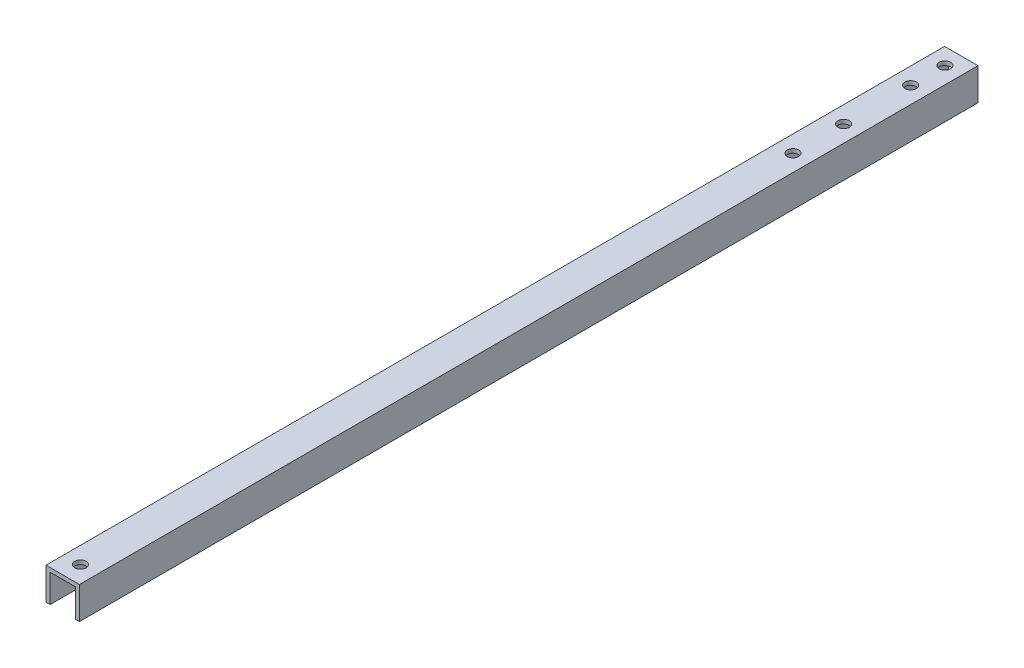
ISO-10303-21;
HEADER;
FILE_DESCRIPTION(('STEP AP214'),'2;1');
FILE_NAME('part.step','',(''),(''),'','','');
FILE_SCHEMA(('AUTOMOTIVE_DESIGN { 1 0 10303 214 1 1 1 1 }'));
ENDSEC;
DATA;
#1=APPLICATION_CONTEXT('core data for automotive mechanical design processes');
#2=APPLICATION_PROTOCOL_DEFINITION('international standard','automotive_design',2000,#1);
#3=PRODUCT_CONTEXT('',#1,'mechanical');
#4=PRODUCT('Part','Part','',(#3));
#5=PRODUCT_RELATED_PRODUCT_CATEGORY('part','',(#4));
#6=PRODUCT_DEFINITION_FORMATION('','',#4);
#7=PRODUCT_DEFINITION_CONTEXT('part definition',#1,'design');
#8=PRODUCT_DEFINITION('design','',#6,#7);
#9=PRODUCT_DEFINITION_SHAPE('','',#8);
#10=(LENGTH_UNIT() NAMED_UNIT(*) SI_UNIT(.MILLI.,.METRE.));
#11=(NAMED_UNIT(*) PLANE_ANGLE_UNIT() SI_UNIT($,.RADIAN.));
#12=(NAMED_UNIT(*) SI_UNIT($,.STERADIAN.) SOLID_ANGLE_UNIT());
#13=UNCERTAINTY_MEASURE_WITH_UNIT(LENGTH_MEASURE(1.E-05),#10,'distance_accuracy_value','');
#14=(GEOMETRIC_REPRESENTATION_CONTEXT(3) GLOBAL_UNCERTAINTY_ASSIGNED_CONTEXT((#13)) GLOBAL_UNIT_ASSIGNED_CONTEXT((#10,
#11,#12)) REPRESENTATION_CONTEXT('',''));
#15=CARTESIAN_POINT('',(0.,0.,0.));
#16=DIRECTION('',(0.,0.,1.));
#17=DIRECTION('',(1.,0.,0.));
#18=AXIS2_PLACEMENT_3D('',#15,#16,#17);
#19=CARTESIAN_POINT('',(-6.604,0.,-355.));
#20=DIRECTION('',(-1.,0.,0.));
#21=DIRECTION('',(0.,-1.,0.));
#22=AXIS2_PLACEMENT_3D('',#19,#20,#21);
#23=PLANE('',#22);
#24=DIRECTION('',(0.,-1.,0.));
#25=VECTOR('',#24,1.);
#26=CARTESIAN_POINT('',(-6.604,0.,0.));
#27=LINE('',#26,#25);
#28=CARTESIAN_POINT('',(-6.604,0.,0.));
#29=VERTEX_POINT('',#28);
#30=CARTESIAN_POINT('',(-6.604,-12.7,0.));
#31=VERTEX_POINT('',#30);
#32=EDGE_CURVE('E135',#29,#31,#27,.T.);
#33=ORIENTED_EDGE('',*,*,#32,.F.);
#34=DIRECTION('',(0.,0.,1.));
#35=VECTOR('',#34,1.);
#36=CARTESIAN_POINT('',(-6.604,0.,-355.));
#37=LINE('',#36,#35);
#38=CARTESIAN_POINT('',(-6.604,0.,-355.));
#39=VERTEX_POINT('',#38);
#40=EDGE_CURVE('E11',#39,#29,#37,.T.);
#41=ORIENTED_EDGE('',*,*,#40,.F.);
#42=DIRECTION('',(0.,-1.,0.));
#43=VECTOR('',#42,1.);
#44=CARTESIAN_POINT('',(-6.604,0.,-355.));
#45=LINE('',#44,#43);
#46=CARTESIAN_POINT('',(-6.604,-12.7,-355.));
#47=VERTEX_POINT('',#46);
#48=EDGE_CURVE('E156',#39,#47,#45,.T.);
#49=ORIENTED_EDGE('',*,*,#48,.T.);
#50=DIRECTION('',(0.,0.,1.));
#51=VECTOR('',#50,1.);
#52=CARTESIAN_POINT('',(-6.604,-12.7,-355.));
#53=LINE('',#52,#51);
#54=EDGE_CURVE('E92',#47,#31,#53,.T.);
#55=ORIENTED_EDGE('',*,*,#54,.T.);
#56=EDGE_LOOP('',(#33,#41,#49,#55));
#57=FACE_BOUND('',#56,.T.);
#58=ADVANCED_FACE('F35',(#57),#23,.T.);
#59=CARTESIAN_POINT('',(-6.604,0.,-355.));
#60=DIRECTION('',(0.,1.,0.));
#61=DIRECTION('',(-1.,0.,0.));
#62=AXIS2_PLACEMENT_3D('',#59,#60,#61);
#63=PLANE('',#62);
#64=CARTESIAN_POINT('',(0.,0.,-7.));
#65=DIRECTION('',(0.,1.,0.));
#66=DIRECTION('',(0.,0.,1.));
#67=AXIS2_PLACEMENT_3D('',#64,#65,#66);
#68=CIRCLE('',#67,2.24999999999999);
#69=CARTESIAN_POINT('',(0.,0.,-4.75000000000001));
#70=VERTEX_POINT('',#69);
#71=EDGE_CURVE('E272',#70,#70,#68,.T.);
#72=ORIENTED_EDGE('',*,*,#71,.F.);
#73=EDGE_LOOP('',(#72));
#74=FACE_BOUND('',#73,.T.);
#75=CARTESIAN_POINT('',(0.,0.,-348.5));
#76=DIRECTION('',(0.,1.,0.));
#77=DIRECTION('',(0.,0.,1.));
#78=AXIS2_PLACEMENT_3D('',#75,#76,#77);
#79=CIRCLE('',#78,2.24999999999999);
#80=CARTESIAN_POINT('',(0.,0.,-346.25));
#81=VERTEX_POINT('',#80);
#82=EDGE_CURVE('E189',#81,#81,#79,.T.);
#83=ORIENTED_EDGE('',*,*,#82,.F.);
#84=EDGE_LOOP('',(#83));
#85=FACE_BOUND('',#84,.T.);
#86=CARTESIAN_POINT('',(0.,0.,-308.5));
#87=DIRECTION('',(0.,1.,0.));
#88=DIRECTION('',(0.,0.,1.));
#89=AXIS2_PLACEMENT_3D('',#86,#87,#88);
#90=CIRCLE('',#89,2.24999999999999);
#91=CARTESIAN_POINT('',(0.,0.,-306.25));
#92=VERTEX_POINT('',#91);
#93=EDGE_CURVE('E178',#92,#92,#90,.T.);
#94=ORIENTED_EDGE('',*,*,#93,.F.);
#95=EDGE_LOOP('',(#94));
#96=FACE_BOUND('',#95,.T.);
#97=CARTESIAN_POINT('',(0.,0.,-335.));
#98=DIRECTION('',(0.,1.,0.));
#99=DIRECTION('',(0.,0.,1.));
#100=AXIS2_PLACEMENT_3D('',#97,#98,#99);
#101=CIRCLE('',#100,2.24999999999999);
#102=CARTESIAN_POINT('',(0.,0.,-332.75));
#103=VERTEX_POINT('',#102);
#104=EDGE_CURVE('E177',#103,#103,#101,.T.);
#105=ORIENTED_EDGE('',*,*,#104,.F.);
#106=EDGE_LOOP('',(#105));
#107=FACE_BOUND('',#106,.T.);
#108=CARTESIAN_POINT('',(0.,0.,-288.5));
#109=DIRECTION('',(0.,1.,0.));
#110=DIRECTION('',(0.,0.,1.));
#111=AXIS2_PLACEMENT_3D('',#108,#109,#110);
#112=CIRCLE('',#111,2.24999999999999);
#113=CARTESIAN_POINT('',(0.,0.,-286.25));
#114=VERTEX_POINT('',#113);
#115=EDGE_CURVE('E174',#114,#114,#112,.T.);
#116=ORIENTED_EDGE('',*,*,#115,.F.);
#117=EDGE_LOOP('',(#116));
#118=FACE_BOUND('',#117,.T.);
#119=DIRECTION('',(-1.,0.,0.));
#120=VECTOR('',#119,1.);
#121=CARTESIAN_POINT('',(-6.604,0.,0.));
#122=LINE('',#121,#120);
#123=CARTESIAN_POINT('',(6.604,0.,0.));
#124=VERTEX_POINT('',#123);
#125=EDGE_CURVE('E154',#124,#29,#122,.T.);
#126=ORIENTED_EDGE('',*,*,#125,.F.);
#127=DIRECTION('',(0.,0.,1.));
#128=VECTOR('',#127,1.);
#129=CARTESIAN_POINT('',(6.604,0.,-355.));
#130=LINE('',#129,#128);
#131=CARTESIAN_POINT('',(6.604,0.,-355.));
#132=VERTEX_POINT('',#131);
#133=EDGE_CURVE('E45',#132,#124,#130,.T.);
#134=ORIENTED_EDGE('',*,*,#133,.F.);
#135=DIRECTION('',(-1.,0.,0.));
#136=VECTOR('',#135,1.);
#137=CARTESIAN_POINT('',(-6.604,0.,-355.));
#138=LINE('',#137,#136);
#139=EDGE_CURVE('E125',#132,#39,#138,.T.);
#140=ORIENTED_EDGE('',*,*,#139,.T.);
#141=ORIENTED_EDGE('',*,*,#40,.T.);
#142=EDGE_LOOP('',(#126,#134,#140,#141));
#143=FACE_BOUND('',#142,.T.);
#144=ADVANCED_FACE('F215',(#74,#85,#96,#107,#118,#143),#63,.T.);
#145=CARTESIAN_POINT('',(6.604,0.,-355.));
#146=DIRECTION('',(1.,0.,0.));
#147=DIRECTION('',(0.,1.,0.));
#148=AXIS2_PLACEMENT_3D('',#145,#146,#147);
#149=PLANE('',#148);
#150=DIRECTION('',(0.,1.,0.));
#151=VECTOR('',#150,1.);
#152=CARTESIAN_POINT('',(6.604,0.,0.));
#153=LINE('',#152,#151);
#154=CARTESIAN_POINT('',(6.604,-12.7,0.));
#155=VERTEX_POINT('',#154);
#156=EDGE_CURVE('E111',#155,#124,#153,.T.);
#157=ORIENTED_EDGE('',*,*,#156,.F.);
#158=DIRECTION('',(0.,0.,1.));
#159=VECTOR('',#158,1.);
#160=CARTESIAN_POINT('',(6.604,-12.7,-355.));
#161=LINE('',#160,#159);
#162=CARTESIAN_POINT('',(6.604,-12.7,-355.));
#163=VERTEX_POINT('',#162);
#164=EDGE_CURVE('E106',#163,#155,#161,.T.);
#165=ORIENTED_EDGE('',*,*,#164,.F.);
#166=DIRECTION('',(0.,1.,0.));
#167=VECTOR('',#166,1.);
#168=CARTESIAN_POINT('',(6.604,0.,-355.));
#169=LINE('',#168,#167);
#170=EDGE_CURVE('E109',#163,#132,#169,.T.);
#171=ORIENTED_EDGE('',*,*,#170,.T.);
#172=ORIENTED_EDGE('',*,*,#133,.T.);
#173=EDGE_LOOP('',(#157,#165,#171,#172));
#174=FACE_BOUND('',#173,.T.);
#175=ADVANCED_FACE('F108',(#174),#149,.T.);
#176=CARTESIAN_POINT('',(6.604,-12.7,-355.));
#177=DIRECTION('',(0.,-1.,0.));
#178=DIRECTION('',(0.,0.,-1.));
#179=AXIS2_PLACEMENT_3D('',#176,#177,#178);
#180=PLANE('',#179);
#181=DIRECTION('',(1.,0.,0.));
#182=VECTOR('',#181,1.);
#183=CARTESIAN_POINT('',(6.604,-12.7,0.));
#184=LINE('',#183,#182);
#185=CARTESIAN_POINT('',(5.0165,-12.7,0.));
#186=VERTEX_POINT('',#185);
#187=EDGE_CURVE('E151',#186,#155,#184,.T.);
#188=ORIENTED_EDGE('',*,*,#187,.F.);
#189=DIRECTION('',(0.,0.,1.));
#190=VECTOR('',#189,1.);
#191=CARTESIAN_POINT('',(5.0165,-12.7,-355.));
#192=LINE('',#191,#190);
#193=CARTESIAN_POINT('',(5.0165,-12.7,-355.));
#194=VERTEX_POINT('',#193);
#195=EDGE_CURVE('E117',#194,#186,#192,.T.);
#196=ORIENTED_EDGE('',*,*,#195,.F.);
#197=DIRECTION('',(1.,0.,0.));
#198=VECTOR('',#197,1.);
#199=CARTESIAN_POINT('',(6.604,-12.7,-355.));
#200=LINE('',#199,#198);
#201=EDGE_CURVE('E123',#194,#163,#200,.T.);
#202=ORIENTED_EDGE('',*,*,#201,.T.);
#203=ORIENTED_EDGE('',*,*,#164,.T.);
#204=EDGE_LOOP('',(#188,#196,#202,#203));
#205=FACE_BOUND('',#204,.T.);
#206=ADVANCED_FACE('F127',(#205),#180,.T.);
#207=CARTESIAN_POINT('',(5.0165,-12.7,-355.));
#208=DIRECTION('',(-1.,0.,0.));
#209=DIRECTION('',(0.,0.,1.));
#210=AXIS2_PLACEMENT_3D('',#207,#208,#209);
#211=PLANE('',#210);
#212=DIRECTION('',(0.,-1.,0.));
#213=VECTOR('',#212,1.);
#214=CARTESIAN_POINT('',(5.0165,-12.7,0.));
#215=LINE('',#214,#213);
#216=CARTESIAN_POINT('',(5.0165,-1.5875,0.));
#217=VERTEX_POINT('',#216);
#218=EDGE_CURVE('E148',#217,#186,#215,.T.);
#219=ORIENTED_EDGE('',*,*,#218,.F.);
#220=DIRECTION('',(0.,0.,1.));
#221=VECTOR('',#220,1.);
#222=CARTESIAN_POINT('',(5.0165,-1.5875,-355.));
#223=LINE('',#222,#221);
#224=CARTESIAN_POINT('',(5.0165,-1.5875,-355.));
#225=VERTEX_POINT('',#224);
#226=EDGE_CURVE('E162',#225,#217,#223,.T.);
#227=ORIENTED_EDGE('',*,*,#226,.F.);
#228=DIRECTION('',(0.,-1.,0.));
#229=VECTOR('',#228,1.);
#230=CARTESIAN_POINT('',(5.0165,-12.7,-355.));
#231=LINE('',#230,#229);
#232=EDGE_CURVE('E128',#225,#194,#231,.T.);
#233=ORIENTED_EDGE('',*,*,#232,.T.);
#234=ORIENTED_EDGE('',*,*,#195,.T.);
#235=EDGE_LOOP('',(#219,#227,#233,#234));
#236=FACE_BOUND('',#235,.T.);
#237=ADVANCED_FACE('F231',(#236),#211,.T.);
#238=CARTESIAN_POINT('',(5.0165,-1.5875,-355.));
#239=DIRECTION('',(0.,-1.,0.));
#240=DIRECTION('',(1.,0.,0.));
#241=AXIS2_PLACEMENT_3D('',#238,#239,#240);
#242=PLANE('',#241);
#243=CARTESIAN_POINT('',(0.,-1.5875,-7.));
#244=DIRECTION('',(0.,-1.,0.));
#245=DIRECTION('',(1.,0.,0.));
#246=AXIS2_PLACEMENT_3D('',#243,#244,#245);
#247=CIRCLE('',#246,2.24999999999997);
#248=CARTESIAN_POINT('',(2.24999999999997,-1.5875,-7.));
#249=VERTEX_POINT('',#248);
#250=EDGE_CURVE('E270',#249,#249,#247,.T.);
#251=ORIENTED_EDGE('',*,*,#250,.F.);
#252=EDGE_LOOP('',(#251));
#253=FACE_BOUND('',#252,.T.);
#254=CARTESIAN_POINT('',(0.,-1.5875,-348.5));
#255=DIRECTION('',(0.,-1.,0.));
#256=DIRECTION('',(1.,0.,0.));
#257=AXIS2_PLACEMENT_3D('',#254,#255,#256);
#258=CIRCLE('',#257,2.24999999999997);
#259=CARTESIAN_POINT('',(2.24999999999997,-1.5875,-348.5));
#260=VERTEX_POINT('',#259);
#261=EDGE_CURVE('E38',#260,#260,#258,.T.);
#262=ORIENTED_EDGE('',*,*,#261,.F.);
#263=EDGE_LOOP('',(#262));
#264=FACE_BOUND('',#263,.T.);
#265=CARTESIAN_POINT('',(0.,-1.5875,-308.5));
#266=DIRECTION('',(0.,-1.,0.));
#267=DIRECTION('',(1.,0.,0.));
#268=AXIS2_PLACEMENT_3D('',#265,#266,#267);
#269=CIRCLE('',#268,2.24999999999997);
#270=CARTESIAN_POINT('',(2.24999999999997,-1.5875,-308.5));
#271=VERTEX_POINT('',#270);
#272=EDGE_CURVE('E175',#271,#271,#269,.T.);
#273=ORIENTED_EDGE('',*,*,#272,.F.);
#274=EDGE_LOOP('',(#273));
#275=FACE_BOUND('',#274,.T.);
#276=CARTESIAN_POINT('',(0.,-1.5875,-335.));
#277=DIRECTION('',(0.,-1.,0.));
#278=DIRECTION('',(1.,0.,0.));
#279=AXIS2_PLACEMENT_3D('',#276,#277,#278);
#280=CIRCLE('',#279,2.24999999999997);
#281=CARTESIAN_POINT('',(2.24999999999997,-1.5875,-335.));
#282=VERTEX_POINT('',#281);
#283=EDGE_CURVE('E182',#282,#282,#280,.T.);
#284=ORIENTED_EDGE('',*,*,#283,.F.);
#285=EDGE_LOOP('',(#284));
#286=FACE_BOUND('',#285,.T.);
#287=CARTESIAN_POINT('',(0.,-1.5875,-288.5));
#288=DIRECTION('',(0.,-1.,0.));
#289=DIRECTION('',(1.,0.,0.));
#290=AXIS2_PLACEMENT_3D('',#287,#288,#289);
#291=CIRCLE('',#290,2.24999999999997);
#292=CARTESIAN_POINT('',(2.24999999999997,-1.5875,-288.5));
#293=VERTEX_POINT('',#292);
#294=EDGE_CURVE('E139',#293,#293,#291,.T.);
#295=ORIENTED_EDGE('',*,*,#294,.F.);
#296=EDGE_LOOP('',(#295));
#297=FACE_BOUND('',#296,.T.);
#298=DIRECTION('',(1.,0.,0.));
#299=VECTOR('',#298,1.);
#300=CARTESIAN_POINT('',(5.0165,-1.5875,0.));
#301=LINE('',#300,#299);
#302=CARTESIAN_POINT('',(-5.0165,-1.5875,0.));
#303=VERTEX_POINT('',#302);
#304=EDGE_CURVE('E145',#303,#217,#301,.T.);
#305=ORIENTED_EDGE('',*,*,#304,.F.);
#306=DIRECTION('',(0.,0.,1.));
#307=VECTOR('',#306,1.);
#308=CARTESIAN_POINT('',(-5.0165,-1.5875,-355.));
#309=LINE('',#308,#307);
#310=CARTESIAN_POINT('',(-5.0165,-1.5875,-355.));
#311=VERTEX_POINT('',#310);
#312=EDGE_CURVE('E165',#311,#303,#309,.T.);
#313=ORIENTED_EDGE('',*,*,#312,.F.);
#314=DIRECTION('',(1.,0.,0.));
#315=VECTOR('',#314,1.);
#316=CARTESIAN_POINT('',(5.0165,-1.5875,-355.));
#317=LINE('',#316,#315);
#318=EDGE_CURVE('E130',#311,#225,#317,.T.);
#319=ORIENTED_EDGE('',*,*,#318,.T.);
#320=ORIENTED_EDGE('',*,*,#226,.T.);
#321=EDGE_LOOP('',(#305,#313,#319,#320));
#322=FACE_BOUND('',#321,.T.);
#323=ADVANCED_FACE('F206',(#253,#264,#275,#286,#297,#322),#242,.T.);
#324=CARTESIAN_POINT('',(-5.0165,-12.7,-355.));
#325=DIRECTION('',(1.,0.,0.));
#326=DIRECTION('',(0.,1.,0.));
#327=AXIS2_PLACEMENT_3D('',#324,#325,#326);
#328=PLANE('',#327);
#329=DIRECTION('',(0.,1.,0.));
#330=VECTOR('',#329,1.);
#331=CARTESIAN_POINT('',(-5.0165,-12.7,0.));
#332=LINE('',#331,#330);
#333=CARTESIAN_POINT('',(-5.0165,-12.7,0.));
#334=VERTEX_POINT('',#333);
#335=EDGE_CURVE('E142',#334,#303,#332,.T.);
#336=ORIENTED_EDGE('',*,*,#335,.F.);
#337=DIRECTION('',(0.,0.,1.));
#338=VECTOR('',#337,1.);
#339=CARTESIAN_POINT('',(-5.0165,-12.7,-355.));
#340=LINE('',#339,#338);
#341=CARTESIAN_POINT('',(-5.0165,-12.7,-355.));
#342=VERTEX_POINT('',#341);
#343=EDGE_CURVE('E168',#342,#334,#340,.T.);
#344=ORIENTED_EDGE('',*,*,#343,.F.);
#345=DIRECTION('',(0.,1.,0.));
#346=VECTOR('',#345,1.);
#347=CARTESIAN_POINT('',(-5.0165,-12.7,-355.));
#348=LINE('',#347,#346);
#349=EDGE_CURVE('E200',#342,#311,#348,.T.);
#350=ORIENTED_EDGE('',*,*,#349,.T.);
#351=ORIENTED_EDGE('',*,*,#312,.T.);
#352=EDGE_LOOP('',(#336,#344,#350,#351));
#353=FACE_BOUND('',#352,.T.);
#354=ADVANCED_FACE('F211',(#353),#328,.T.);
#355=CARTESIAN_POINT('',(-6.604,-12.7,-355.));
#356=DIRECTION('',(0.,-1.,0.));
#357=DIRECTION('',(0.,0.,-1.));
#358=AXIS2_PLACEMENT_3D('',#355,#356,#357);
#359=PLANE('',#358);
#360=DIRECTION('',(1.,0.,0.));
#361=VECTOR('',#360,1.);
#362=CARTESIAN_POINT('',(-6.604,-12.7,0.));
#363=LINE('',#362,#361);
#364=EDGE_CURVE('E138',#31,#334,#363,.T.);
#365=ORIENTED_EDGE('',*,*,#364,.F.);
#366=ORIENTED_EDGE('',*,*,#54,.F.);
#367=DIRECTION('',(1.,0.,0.));
#368=VECTOR('',#367,1.);
#369=CARTESIAN_POINT('',(-6.604,-12.7,-355.));
#370=LINE('',#369,#368);
#371=EDGE_CURVE('E198',#47,#342,#370,.T.);
#372=ORIENTED_EDGE('',*,*,#371,.T.);
#373=ORIENTED_EDGE('',*,*,#343,.T.);
#374=EDGE_LOOP('',(#365,#366,#372,#373));
#375=FACE_BOUND('',#374,.T.);
#376=ADVANCED_FACE('F212',(#375),#359,.T.);
#377=CARTESIAN_POINT('',(0.,0.,-355.));
#378=DIRECTION('',(0.,0.,1.));
#379=DIRECTION('',(1.,0.,0.));
#380=AXIS2_PLACEMENT_3D('',#377,#378,#379);
#381=PLANE('',#380);
#382=ORIENTED_EDGE('',*,*,#48,.F.);
#383=ORIENTED_EDGE('',*,*,#139,.F.);
#384=ORIENTED_EDGE('',*,*,#170,.F.);
#385=ORIENTED_EDGE('',*,*,#201,.F.);
#386=ORIENTED_EDGE('',*,*,#232,.F.);
#387=ORIENTED_EDGE('',*,*,#318,.F.);
#388=ORIENTED_EDGE('',*,*,#349,.F.);
#389=ORIENTED_EDGE('',*,*,#371,.F.);
#390=EDGE_LOOP('',(#382,#383,#384,#385,#386,#387,#388,#389));
#391=FACE_BOUND('',#390,.T.);
#392=ADVANCED_FACE('F121',(#391),#381,.F.);
#393=CARTESIAN_POINT('',(0.,0.,0.));
#394=DIRECTION('',(0.,0.,1.));
#395=DIRECTION('',(1.,0.,0.));
#396=AXIS2_PLACEMENT_3D('',#393,#394,#395);
#397=PLANE('',#396);
#398=ORIENTED_EDGE('',*,*,#32,.T.);
#399=ORIENTED_EDGE('',*,*,#364,.T.);
#400=ORIENTED_EDGE('',*,*,#335,.T.);
#401=ORIENTED_EDGE('',*,*,#304,.T.);
#402=ORIENTED_EDGE('',*,*,#218,.T.);
#403=ORIENTED_EDGE('',*,*,#187,.T.);
#404=ORIENTED_EDGE('',*,*,#156,.T.);
#405=ORIENTED_EDGE('',*,*,#125,.T.);
#406=EDGE_LOOP('',(#398,#399,#400,#401,#402,#403,#404,#405));
#407=FACE_BOUND('',#406,.T.);
#408=ADVANCED_FACE('F214',(#407),#397,.T.);
#409=CARTESIAN_POINT('',(0.,0.,-288.5));
#410=DIRECTION('',(0.,1.,0.));
#411=DIRECTION('',(0.,0.,1.));
#412=AXIS2_PLACEMENT_3D('',#409,#410,#411);
#413=CYLINDRICAL_SURFACE('',#412,2.24999999999997);
#414=ORIENTED_EDGE('',*,*,#294,.T.);
#415=EDGE_LOOP('',(#414));
#416=FACE_BOUND('',#415,.T.);
#417=ORIENTED_EDGE('',*,*,#115,.T.);
#418=EDGE_LOOP('',(#417));
#419=FACE_BOUND('',#418,.T.);
#420=ADVANCED_FACE('F246',(#416,#419),#413,.F.);
#421=CARTESIAN_POINT('',(0.,0.,-335.));
#422=DIRECTION('',(0.,1.,0.));
#423=DIRECTION('',(0.,0.,1.));
#424=AXIS2_PLACEMENT_3D('',#421,#422,#423);
#425=CYLINDRICAL_SURFACE('',#424,2.24999999999997);
#426=ORIENTED_EDGE('',*,*,#283,.T.);
#427=EDGE_LOOP('',(#426));
#428=FACE_BOUND('',#427,.T.);
#429=ORIENTED_EDGE('',*,*,#104,.T.);
#430=EDGE_LOOP('',(#429));
#431=FACE_BOUND('',#430,.T.);
#432=ADVANCED_FACE('F250',(#428,#431),#425,.F.);
#433=CARTESIAN_POINT('',(0.,0.,-308.5));
#434=DIRECTION('',(0.,1.,0.));
#435=DIRECTION('',(0.,0.,1.));
#436=AXIS2_PLACEMENT_3D('',#433,#434,#435);
#437=CYLINDRICAL_SURFACE('',#436,2.24999999999997);
#438=ORIENTED_EDGE('',*,*,#272,.T.);
#439=EDGE_LOOP('',(#438));
#440=FACE_BOUND('',#439,.T.);
#441=ORIENTED_EDGE('',*,*,#93,.T.);
#442=EDGE_LOOP('',(#441));
#443=FACE_BOUND('',#442,.T.);
#444=ADVANCED_FACE('F254',(#440,#443),#437,.F.);
#445=CARTESIAN_POINT('',(0.,0.,-348.5));
#446=DIRECTION('',(0.,1.,0.));
#447=DIRECTION('',(0.,0.,1.));
#448=AXIS2_PLACEMENT_3D('',#445,#446,#447);
#449=CYLINDRICAL_SURFACE('',#448,2.24999999999997);
#450=ORIENTED_EDGE('',*,*,#261,.T.);
#451=EDGE_LOOP('',(#450));
#452=FACE_BOUND('',#451,.T.);
#453=ORIENTED_EDGE('',*,*,#82,.T.);
#454=EDGE_LOOP('',(#453));
#455=FACE_BOUND('',#454,.T.);
#456=ADVANCED_FACE('F258',(#452,#455),#449,.F.);
#457=CARTESIAN_POINT('',(0.,0.,-7.));
#458=DIRECTION('',(0.,1.,0.));
#459=DIRECTION('',(0.,0.,1.));
#460=AXIS2_PLACEMENT_3D('',#457,#458,#459);
#461=CYLINDRICAL_SURFACE('',#460,2.24999999999997);
#462=ORIENTED_EDGE('',*,*,#250,.T.);
#463=EDGE_LOOP('',(#462));
#464=FACE_BOUND('',#463,.T.);
#465=ORIENTED_EDGE('',*,*,#71,.T.);
#466=EDGE_LOOP('',(#465));
#467=FACE_BOUND('',#466,.T.);
#468=ADVANCED_FACE('F261',(#464,#467),#461,.F.);
#469=CLOSED_SHELL('',(#58,#144,#175,#206,#237,#323,#354,#376,#392,#408,#420,#432,#444,#456,#468));
#470=MANIFOLD_SOLID_BREP('B2',#469);
#471=ADVANCED_BREP_SHAPE_REPRESENTATION('',(#18,#470),#14);
#472=SHAPE_DEFINITION_REPRESENTATION(#9,#471);
ENDSEC;
END-ISO-10303-21;
